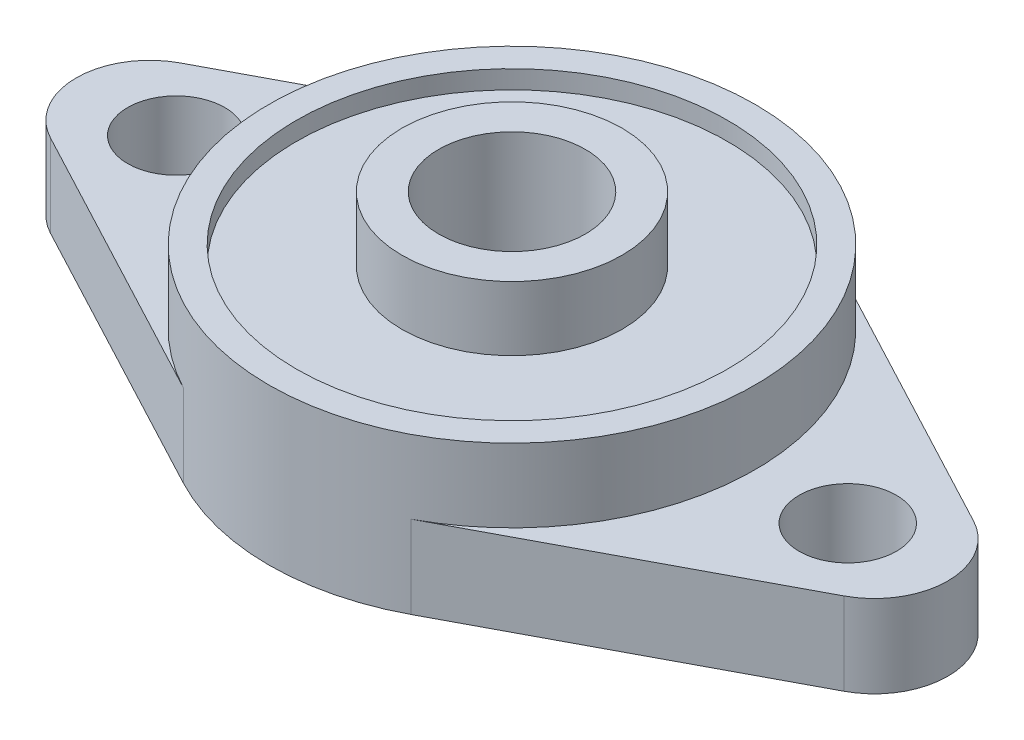
ISO-10303-21;
HEADER;
FILE_DESCRIPTION(('STEP AP214'),'2;1');
FILE_NAME('part.step','',(''),(''),'','','');
FILE_SCHEMA(('AUTOMOTIVE_DESIGN { 1 0 10303 214 1 1 1 1 }'));
ENDSEC;
DATA;
#1=APPLICATION_CONTEXT('core data for automotive mechanical design processes');
#2=APPLICATION_PROTOCOL_DEFINITION('international standard','automotive_design',2000,#1);
#3=PRODUCT_CONTEXT('',#1,'mechanical');
#4=PRODUCT('Part','Part','',(#3));
#5=PRODUCT_RELATED_PRODUCT_CATEGORY('part','',(#4));
#6=PRODUCT_DEFINITION_FORMATION('','',#4);
#7=PRODUCT_DEFINITION_CONTEXT('part definition',#1,'design');
#8=PRODUCT_DEFINITION('design','',#6,#7);
#9=PRODUCT_DEFINITION_SHAPE('','',#8);
#10=(LENGTH_UNIT() NAMED_UNIT(*) SI_UNIT(.MILLI.,.METRE.));
#11=(NAMED_UNIT(*) PLANE_ANGLE_UNIT() SI_UNIT($,.RADIAN.));
#12=(NAMED_UNIT(*) SI_UNIT($,.STERADIAN.) SOLID_ANGLE_UNIT());
#13=UNCERTAINTY_MEASURE_WITH_UNIT(LENGTH_MEASURE(1.E-05),#10,'distance_accuracy_value','');
#14=(GEOMETRIC_REPRESENTATION_CONTEXT(3) GLOBAL_UNCERTAINTY_ASSIGNED_CONTEXT((#13)) GLOBAL_UNIT_ASSIGNED_CONTEXT((#10,
#11,#12)) REPRESENTATION_CONTEXT('',''));
#15=CARTESIAN_POINT('',(0.,0.,0.));
#16=DIRECTION('',(0.,0.,1.));
#17=DIRECTION('',(1.,0.,0.));
#18=AXIS2_PLACEMENT_3D('',#15,#16,#17);
#19=CARTESIAN_POINT('',(0.,8.5,0.));
#20=DIRECTION('',(0.,1.,0.));
#21=DIRECTION('',(0.,0.,1.));
#22=AXIS2_PLACEMENT_3D('',#19,#20,#21);
#23=PLANE('',#22);
#24=CARTESIAN_POINT('',(0.,8.5,0.));
#25=DIRECTION('',(0.,1.,0.));
#26=DIRECTION('',(0.,0.,1.));
#27=AXIS2_PLACEMENT_3D('',#24,#25,#26);
#28=CIRCLE('',#27,11.75);
#29=CARTESIAN_POINT('',(0.,8.5,11.75));
#30=VERTEX_POINT('',#29);
#31=EDGE_CURVE('E207',#30,#30,#28,.T.);
#32=ORIENTED_EDGE('',*,*,#31,.F.);
#33=EDGE_LOOP('',(#32));
#34=FACE_BOUND('',#33,.T.);
#35=CARTESIAN_POINT('',(0.,8.5,0.));
#36=DIRECTION('',(0.,1.,0.));
#37=DIRECTION('',(0.,0.,1.));
#38=AXIS2_PLACEMENT_3D('',#35,#36,#37);
#39=CIRCLE('',#38,13.25);
#40=CARTESIAN_POINT('',(0.,8.5,13.25));
#41=VERTEX_POINT('',#40);
#42=EDGE_CURVE('E196',#41,#41,#39,.T.);
#43=ORIENTED_EDGE('',*,*,#42,.T.);
#44=EDGE_LOOP('',(#43));
#45=FACE_BOUND('',#44,.T.);
#46=ADVANCED_FACE('F34',(#34,#45),#23,.T.);
#47=CARTESIAN_POINT('',(0.,4.5,0.));
#48=DIRECTION('',(0.,-1.,0.));
#49=DIRECTION('',(0.,0.,-1.));
#50=AXIS2_PLACEMENT_3D('',#47,#48,#49);
#51=PLANE('',#50);
#52=CARTESIAN_POINT('',(18.3,4.5,0.));
#53=DIRECTION('',(0.,1.,0.));
#54=DIRECTION('',(0.,0.,1.));
#55=AXIS2_PLACEMENT_3D('',#52,#53,#54);
#56=CIRCLE('',#55,2.65);
#57=CARTESIAN_POINT('',(18.3,4.5,2.65));
#58=VERTEX_POINT('',#57);
#59=EDGE_CURVE('E186',#58,#58,#56,.T.);
#60=ORIENTED_EDGE('',*,*,#59,.F.);
#61=EDGE_LOOP('',(#60));
#62=FACE_BOUND('',#61,.T.);
#63=CARTESIAN_POINT('',(0.,4.5,0.));
#64=DIRECTION('',(0.,1.,0.));
#65=DIRECTION('',(0.,0.,1.));
#66=AXIS2_PLACEMENT_3D('',#63,#64,#65);
#67=CIRCLE('',#66,13.25);
#68=CARTESIAN_POINT('',(6.20569620253165,4.5,11.706913967476));
#69=VERTEX_POINT('',#68);
#70=CARTESIAN_POINT('',(6.20569620253165,4.5,-11.706913967476));
#71=VERTEX_POINT('',#70);
#72=EDGE_CURVE('E45',#69,#71,#67,.T.);
#73=ORIENTED_EDGE('',*,*,#72,.F.);
#74=DIRECTION('',(0.88354067679064,0.,-0.468354430379747));
#75=VECTOR('',#74,1.);
#76=CARTESIAN_POINT('',(6.20569620253165,4.5,11.706913967476));
#77=LINE('',#76,#75);
#78=CARTESIAN_POINT('',(21.623417721519,4.5,3.53416270716256));
#79=VERTEX_POINT('',#78);
#80=EDGE_CURVE('E107',#69,#79,#77,.T.);
#81=ORIENTED_EDGE('',*,*,#80,.T.);
#82=CARTESIAN_POINT('',(19.75,4.5,0.));
#83=DIRECTION('',(0.,1.,0.));
#84=DIRECTION('',(0.,0.,-1.));
#85=AXIS2_PLACEMENT_3D('',#82,#83,#84);
#86=CIRCLE('',#85,4.);
#87=CARTESIAN_POINT('',(21.623417721519,4.5,-3.53416270716256));
#88=VERTEX_POINT('',#87);
#89=EDGE_CURVE('E111',#79,#88,#86,.T.);
#90=ORIENTED_EDGE('',*,*,#89,.T.);
#91=DIRECTION('',(-0.88354067679064,0.,-0.468354430379747));
#92=VECTOR('',#91,1.);
#93=CARTESIAN_POINT('',(6.20569620253165,4.5,-11.706913967476));
#94=LINE('',#93,#92);
#95=EDGE_CURVE('E53',#88,#71,#94,.T.);
#96=ORIENTED_EDGE('',*,*,#95,.T.);
#97=EDGE_LOOP('',(#73,#81,#90,#96));
#98=FACE_BOUND('',#97,.T.);
#99=ADVANCED_FACE('F109',(#62,#98),#51,.F.);
#100=CARTESIAN_POINT('',(-18.3,4.5,0.));
#101=DIRECTION('',(0.,1.,0.));
#102=DIRECTION('',(0.,0.,1.));
#103=AXIS2_PLACEMENT_3D('',#100,#101,#102);
#104=CIRCLE('',#103,2.65);
#105=CARTESIAN_POINT('',(-18.3,4.5,2.65));
#106=VERTEX_POINT('',#105);
#107=EDGE_CURVE('E135',#106,#106,#104,.T.);
#108=ORIENTED_EDGE('',*,*,#107,.F.);
#109=EDGE_LOOP('',(#108));
#110=FACE_BOUND('',#109,.T.);
#111=CARTESIAN_POINT('',(-6.20569620253165,4.5,-11.706913967476));
#112=VERTEX_POINT('',#111);
#113=CARTESIAN_POINT('',(-6.20569620253164,4.5,11.706913967476));
#114=VERTEX_POINT('',#113);
#115=EDGE_CURVE('E11',#112,#114,#67,.T.);
#116=ORIENTED_EDGE('',*,*,#115,.F.);
#117=DIRECTION('',(-0.88354067679064,0.,0.468354430379747));
#118=VECTOR('',#117,1.);
#119=CARTESIAN_POINT('',(-6.20569620253165,4.5,-11.706913967476));
#120=LINE('',#119,#118);
#121=CARTESIAN_POINT('',(-21.623417721519,4.5,-3.53416270716256));
#122=VERTEX_POINT('',#121);
#123=EDGE_CURVE('E146',#112,#122,#120,.T.);
#124=ORIENTED_EDGE('',*,*,#123,.T.);
#125=CARTESIAN_POINT('',(-19.75,4.5,0.));
#126=DIRECTION('',(0.,1.,0.));
#127=DIRECTION('',(0.,0.,1.));
#128=AXIS2_PLACEMENT_3D('',#125,#126,#127);
#129=CIRCLE('',#128,4.);
#130=CARTESIAN_POINT('',(-21.623417721519,4.5,3.53416270716256));
#131=VERTEX_POINT('',#130);
#132=EDGE_CURVE('E179',#122,#131,#129,.T.);
#133=ORIENTED_EDGE('',*,*,#132,.T.);
#134=DIRECTION('',(0.88354067679064,0.,0.468354430379747));
#135=VECTOR('',#134,1.);
#136=CARTESIAN_POINT('',(-6.20569620253165,4.5,11.706913967476));
#137=LINE('',#136,#135);
#138=EDGE_CURVE('E116',#131,#114,#137,.T.);
#139=ORIENTED_EDGE('',*,*,#138,.T.);
#140=EDGE_LOOP('',(#116,#124,#133,#139));
#141=FACE_BOUND('',#140,.T.);
#142=ADVANCED_FACE('F250',(#110,#141),#51,.F.);
#143=CARTESIAN_POINT('',(0.,0.,0.));
#144=DIRECTION('',(0.,-1.,0.));
#145=DIRECTION('',(0.,0.,-1.));
#146=AXIS2_PLACEMENT_3D('',#143,#144,#145);
#147=PLANE('',#146);
#148=CARTESIAN_POINT('',(18.3,0.,0.));
#149=DIRECTION('',(0.,1.,0.));
#150=DIRECTION('',(0.,0.,1.));
#151=AXIS2_PLACEMENT_3D('',#148,#149,#150);
#152=CIRCLE('',#151,2.65);
#153=CARTESIAN_POINT('',(18.3,0.,2.65));
#154=VERTEX_POINT('',#153);
#155=EDGE_CURVE('E189',#154,#154,#152,.T.);
#156=ORIENTED_EDGE('',*,*,#155,.T.);
#157=EDGE_LOOP('',(#156));
#158=FACE_BOUND('',#157,.T.);
#159=CARTESIAN_POINT('',(0.,0.,0.));
#160=DIRECTION('',(0.,1.,0.));
#161=DIRECTION('',(0.,0.,-1.));
#162=AXIS2_PLACEMENT_3D('',#159,#160,#161);
#163=CIRCLE('',#162,13.25);
#164=CARTESIAN_POINT('',(6.20569620253165,0.,-11.706913967476));
#165=VERTEX_POINT('',#164);
#166=CARTESIAN_POINT('',(-6.20569620253165,0.,-11.706913967476));
#167=VERTEX_POINT('',#166);
#168=EDGE_CURVE('E131',#165,#167,#163,.T.);
#169=ORIENTED_EDGE('',*,*,#168,.F.);
#170=DIRECTION('',(-0.88354067679064,0.,-0.468354430379747));
#171=VECTOR('',#170,1.);
#172=CARTESIAN_POINT('',(6.20569620253165,0.,-11.706913967476));
#173=LINE('',#172,#171);
#174=CARTESIAN_POINT('',(21.623417721519,0.,-3.53416270716256));
#175=VERTEX_POINT('',#174);
#176=EDGE_CURVE('E89',#175,#165,#173,.T.);
#177=ORIENTED_EDGE('',*,*,#176,.F.);
#178=CARTESIAN_POINT('',(19.75,0.,0.));
#179=DIRECTION('',(0.,1.,0.));
#180=DIRECTION('',(0.,0.,-1.));
#181=AXIS2_PLACEMENT_3D('',#178,#179,#180);
#182=CIRCLE('',#181,4.);
#183=CARTESIAN_POINT('',(21.623417721519,0.,3.53416270716256));
#184=VERTEX_POINT('',#183);
#185=EDGE_CURVE('E83',#184,#175,#182,.T.);
#186=ORIENTED_EDGE('',*,*,#185,.F.);
#187=DIRECTION('',(0.88354067679064,0.,-0.468354430379747));
#188=VECTOR('',#187,1.);
#189=CARTESIAN_POINT('',(6.20569620253165,0.,11.706913967476));
#190=LINE('',#189,#188);
#191=CARTESIAN_POINT('',(6.20569620253165,0.,11.706913967476));
#192=VERTEX_POINT('',#191);
#193=EDGE_CURVE('E121',#192,#184,#190,.T.);
#194=ORIENTED_EDGE('',*,*,#193,.F.);
#195=CARTESIAN_POINT('',(0.,0.,0.));
#196=DIRECTION('',(0.,1.,0.));
#197=DIRECTION('',(0.,0.,1.));
#198=AXIS2_PLACEMENT_3D('',#195,#196,#197);
#199=CIRCLE('',#198,13.25);
#200=CARTESIAN_POINT('',(-6.20569620253164,0.,11.706913967476));
#201=VERTEX_POINT('',#200);
#202=EDGE_CURVE('E141',#201,#192,#199,.T.);
#203=ORIENTED_EDGE('',*,*,#202,.F.);
#204=DIRECTION('',(0.88354067679064,0.,0.468354430379747));
#205=VECTOR('',#204,1.);
#206=CARTESIAN_POINT('',(-6.20569620253165,0.,11.706913967476));
#207=LINE('',#206,#205);
#208=CARTESIAN_POINT('',(-21.623417721519,0.,3.53416270716256));
#209=VERTEX_POINT('',#208);
#210=EDGE_CURVE('E139',#209,#201,#207,.T.);
#211=ORIENTED_EDGE('',*,*,#210,.F.);
#212=CARTESIAN_POINT('',(-19.75,0.,0.));
#213=DIRECTION('',(0.,1.,0.));
#214=DIRECTION('',(0.,0.,1.));
#215=AXIS2_PLACEMENT_3D('',#212,#213,#214);
#216=CIRCLE('',#215,4.);
#217=CARTESIAN_POINT('',(-21.623417721519,0.,-3.53416270716256));
#218=VERTEX_POINT('',#217);
#219=EDGE_CURVE('E137',#218,#209,#216,.T.);
#220=ORIENTED_EDGE('',*,*,#219,.F.);
#221=DIRECTION('',(-0.88354067679064,0.,0.468354430379747));
#222=VECTOR('',#221,1.);
#223=CARTESIAN_POINT('',(-6.20569620253165,0.,-11.706913967476));
#224=LINE('',#223,#222);
#225=EDGE_CURVE('E134',#167,#218,#224,.T.);
#226=ORIENTED_EDGE('',*,*,#225,.F.);
#227=EDGE_LOOP('',(#169,#177,#186,#194,#203,#211,#220,#226));
#228=FACE_BOUND('',#227,.T.);
#229=CARTESIAN_POINT('',(-18.3,0.,0.));
#230=DIRECTION('',(0.,1.,0.));
#231=DIRECTION('',(0.,0.,1.));
#232=AXIS2_PLACEMENT_3D('',#229,#230,#231);
#233=CIRCLE('',#232,2.65);
#234=CARTESIAN_POINT('',(-18.3,0.,2.65));
#235=VERTEX_POINT('',#234);
#236=EDGE_CURVE('E183',#235,#235,#233,.T.);
#237=ORIENTED_EDGE('',*,*,#236,.T.);
#238=EDGE_LOOP('',(#237));
#239=FACE_BOUND('',#238,.T.);
#240=CARTESIAN_POINT('',(0.,0.,0.));
#241=DIRECTION('',(0.,1.,0.));
#242=DIRECTION('',(0.,0.,1.));
#243=AXIS2_PLACEMENT_3D('',#240,#241,#242);
#244=CIRCLE('',#243,4.);
#245=CARTESIAN_POINT('',(0.,0.,4.));
#246=VERTEX_POINT('',#245);
#247=EDGE_CURVE('E192',#246,#246,#244,.T.);
#248=ORIENTED_EDGE('',*,*,#247,.T.);
#249=EDGE_LOOP('',(#248));
#250=FACE_BOUND('',#249,.T.);
#251=ADVANCED_FACE('F169',(#158,#228,#239,#250),#147,.T.);
#252=CARTESIAN_POINT('',(-6.20569620253165,4.5,-11.706913967476));
#253=DIRECTION('',(0.468354430379747,0.,0.88354067679064));
#254=DIRECTION('',(0.883540676790641,0.,-0.468354430379747));
#255=AXIS2_PLACEMENT_3D('',#252,#253,#254);
#256=PLANE('',#255);
#257=ORIENTED_EDGE('',*,*,#225,.T.);
#258=DIRECTION('',(0.,-1.,0.));
#259=VECTOR('',#258,1.);
#260=CARTESIAN_POINT('',(-21.623417721519,4.5,-3.53416270716256));
#261=LINE('',#260,#259);
#262=EDGE_CURVE('E155',#122,#218,#261,.T.);
#263=ORIENTED_EDGE('',*,*,#262,.F.);
#264=ORIENTED_EDGE('',*,*,#123,.F.);
#265=DIRECTION('',(0.,-1.,0.));
#266=VECTOR('',#265,1.);
#267=CARTESIAN_POINT('',(-6.20569620253165,4.5,-11.706913967476));
#268=LINE('',#267,#266);
#269=EDGE_CURVE('E38',#112,#167,#268,.T.);
#270=ORIENTED_EDGE('',*,*,#269,.T.);
#271=EDGE_LOOP('',(#257,#263,#264,#270));
#272=FACE_BOUND('',#271,.T.);
#273=ADVANCED_FACE('F36',(#272),#256,.F.);
#274=CARTESIAN_POINT('',(-19.75,4.5,0.));
#275=DIRECTION('',(0.,-1.,0.));
#276=DIRECTION('',(0.,0.,-1.));
#277=AXIS2_PLACEMENT_3D('',#274,#275,#276);
#278=CYLINDRICAL_SURFACE('',#277,4.);
#279=ORIENTED_EDGE('',*,*,#219,.T.);
#280=DIRECTION('',(0.,-1.,0.));
#281=VECTOR('',#280,1.);
#282=CARTESIAN_POINT('',(-21.623417721519,4.5,3.53416270716256));
#283=LINE('',#282,#281);
#284=EDGE_CURVE('E153',#131,#209,#283,.T.);
#285=ORIENTED_EDGE('',*,*,#284,.F.);
#286=ORIENTED_EDGE('',*,*,#132,.F.);
#287=ORIENTED_EDGE('',*,*,#262,.T.);
#288=EDGE_LOOP('',(#279,#285,#286,#287));
#289=FACE_BOUND('',#288,.T.);
#290=ADVANCED_FACE('F174',(#289),#278,.T.);
#291=CARTESIAN_POINT('',(-6.20569620253165,4.5,11.706913967476));
#292=DIRECTION('',(0.468354430379747,0.,-0.88354067679064));
#293=DIRECTION('',(-0.883540676790641,0.,-0.468354430379747));
#294=AXIS2_PLACEMENT_3D('',#291,#292,#293);
#295=PLANE('',#294);
#296=ORIENTED_EDGE('',*,*,#210,.T.);
#297=DIRECTION('',(0.,-1.,0.));
#298=VECTOR('',#297,1.);
#299=CARTESIAN_POINT('',(-6.20569620253164,4.5,11.706913967476));
#300=LINE('',#299,#298);
#301=EDGE_CURVE('E150',#114,#201,#300,.T.);
#302=ORIENTED_EDGE('',*,*,#301,.F.);
#303=ORIENTED_EDGE('',*,*,#138,.F.);
#304=ORIENTED_EDGE('',*,*,#284,.T.);
#305=EDGE_LOOP('',(#296,#302,#303,#304));
#306=FACE_BOUND('',#305,.T.);
#307=ADVANCED_FACE('F177',(#306),#295,.F.);
#308=CARTESIAN_POINT('',(0.,4.5,0.));
#309=DIRECTION('',(0.,-1.,0.));
#310=DIRECTION('',(0.,0.,-1.));
#311=AXIS2_PLACEMENT_3D('',#308,#309,#310);
#312=CYLINDRICAL_SURFACE('',#311,13.25);
#313=ORIENTED_EDGE('',*,*,#202,.T.);
#314=DIRECTION('',(0.,-1.,0.));
#315=VECTOR('',#314,1.);
#316=CARTESIAN_POINT('',(6.20569620253165,4.5,11.706913967476));
#317=LINE('',#316,#315);
#318=EDGE_CURVE('E122',#69,#192,#317,.T.);
#319=ORIENTED_EDGE('',*,*,#318,.F.);
#320=ORIENTED_EDGE('',*,*,#72,.T.);
#321=DIRECTION('',(0.,-1.,0.));
#322=VECTOR('',#321,1.);
#323=CARTESIAN_POINT('',(6.20569620253165,4.5,-11.706913967476));
#324=LINE('',#323,#322);
#325=EDGE_CURVE('E127',#71,#165,#324,.T.);
#326=ORIENTED_EDGE('',*,*,#325,.T.);
#327=ORIENTED_EDGE('',*,*,#168,.T.);
#328=ORIENTED_EDGE('',*,*,#269,.F.);
#329=ORIENTED_EDGE('',*,*,#115,.T.);
#330=ORIENTED_EDGE('',*,*,#301,.T.);
#331=EDGE_LOOP('',(#313,#319,#320,#326,#327,#328,#329,#330));
#332=FACE_BOUND('',#331,.T.);
#333=ORIENTED_EDGE('',*,*,#42,.F.);
#334=EDGE_LOOP('',(#333));
#335=FACE_BOUND('',#334,.T.);
#336=ADVANCED_FACE('F166',(#332,#335),#312,.T.);
#337=CARTESIAN_POINT('',(6.20569620253165,4.5,11.706913967476));
#338=DIRECTION('',(-0.468354430379747,0.,-0.88354067679064));
#339=DIRECTION('',(-0.883540676790641,0.,0.468354430379747));
#340=AXIS2_PLACEMENT_3D('',#337,#338,#339);
#341=PLANE('',#340);
#342=ORIENTED_EDGE('',*,*,#193,.T.);
#343=DIRECTION('',(0.,-1.,0.));
#344=VECTOR('',#343,1.);
#345=CARTESIAN_POINT('',(21.623417721519,4.5,3.53416270716256));
#346=LINE('',#345,#344);
#347=EDGE_CURVE('E118',#79,#184,#346,.T.);
#348=ORIENTED_EDGE('',*,*,#347,.F.);
#349=ORIENTED_EDGE('',*,*,#80,.F.);
#350=ORIENTED_EDGE('',*,*,#318,.T.);
#351=EDGE_LOOP('',(#342,#348,#349,#350));
#352=FACE_BOUND('',#351,.T.);
#353=ADVANCED_FACE('F119',(#352),#341,.F.);
#354=CARTESIAN_POINT('',(19.75,4.5,0.));
#355=DIRECTION('',(0.,-1.,0.));
#356=DIRECTION('',(0.,0.,-1.));
#357=AXIS2_PLACEMENT_3D('',#354,#355,#356);
#358=CYLINDRICAL_SURFACE('',#357,4.);
#359=ORIENTED_EDGE('',*,*,#185,.T.);
#360=DIRECTION('',(0.,-1.,0.));
#361=VECTOR('',#360,1.);
#362=CARTESIAN_POINT('',(21.623417721519,4.5,-3.53416270716256));
#363=LINE('',#362,#361);
#364=EDGE_CURVE('E123',#88,#175,#363,.T.);
#365=ORIENTED_EDGE('',*,*,#364,.F.);
#366=ORIENTED_EDGE('',*,*,#89,.F.);
#367=ORIENTED_EDGE('',*,*,#347,.T.);
#368=EDGE_LOOP('',(#359,#365,#366,#367));
#369=FACE_BOUND('',#368,.T.);
#370=ADVANCED_FACE('F125',(#369),#358,.T.);
#371=CARTESIAN_POINT('',(6.20569620253165,4.5,-11.706913967476));
#372=DIRECTION('',(-0.468354430379747,0.,0.88354067679064));
#373=DIRECTION('',(0.883540676790641,0.,0.468354430379747));
#374=AXIS2_PLACEMENT_3D('',#371,#372,#373);
#375=PLANE('',#374);
#376=ORIENTED_EDGE('',*,*,#176,.T.);
#377=ORIENTED_EDGE('',*,*,#325,.F.);
#378=ORIENTED_EDGE('',*,*,#95,.F.);
#379=ORIENTED_EDGE('',*,*,#364,.T.);
#380=EDGE_LOOP('',(#376,#377,#378,#379));
#381=FACE_BOUND('',#380,.T.);
#382=ADVANCED_FACE('F260',(#381),#375,.F.);
#383=CARTESIAN_POINT('',(-18.3,4.5,0.));
#384=DIRECTION('',(0.,-1.,0.));
#385=DIRECTION('',(0.,0.,-1.));
#386=AXIS2_PLACEMENT_3D('',#383,#384,#385);
#387=CYLINDRICAL_SURFACE('',#386,2.65);
#388=ORIENTED_EDGE('',*,*,#107,.T.);
#389=EDGE_LOOP('',(#388));
#390=FACE_BOUND('',#389,.T.);
#391=ORIENTED_EDGE('',*,*,#236,.F.);
#392=EDGE_LOOP('',(#391));
#393=FACE_BOUND('',#392,.T.);
#394=ADVANCED_FACE('F262',(#390,#393),#387,.F.);
#395=CARTESIAN_POINT('',(18.3,4.5,0.));
#396=DIRECTION('',(0.,-1.,0.));
#397=DIRECTION('',(0.,0.,-1.));
#398=AXIS2_PLACEMENT_3D('',#395,#396,#397);
#399=CYLINDRICAL_SURFACE('',#398,2.65);
#400=ORIENTED_EDGE('',*,*,#59,.T.);
#401=EDGE_LOOP('',(#400));
#402=FACE_BOUND('',#401,.T.);
#403=ORIENTED_EDGE('',*,*,#155,.F.);
#404=EDGE_LOOP('',(#403));
#405=FACE_BOUND('',#404,.T.);
#406=ADVANCED_FACE('F279',(#402,#405),#399,.F.);
#407=CARTESIAN_POINT('',(0.,4.5,0.));
#408=DIRECTION('',(0.,-1.,0.));
#409=DIRECTION('',(0.,0.,-1.));
#410=AXIS2_PLACEMENT_3D('',#407,#408,#409);
#411=CYLINDRICAL_SURFACE('',#410,4.);
#412=ORIENTED_EDGE('',*,*,#247,.F.);
#413=EDGE_LOOP('',(#412));
#414=FACE_BOUND('',#413,.T.);
#415=CARTESIAN_POINT('',(0.,11.,0.));
#416=DIRECTION('',(0.,1.,0.));
#417=DIRECTION('',(0.,0.,1.));
#418=AXIS2_PLACEMENT_3D('',#415,#416,#417);
#419=CIRCLE('',#418,4.);
#420=CARTESIAN_POINT('',(0.,11.,4.));
#421=VERTEX_POINT('',#420);
#422=EDGE_CURVE('E203',#421,#421,#419,.T.);
#423=ORIENTED_EDGE('',*,*,#422,.T.);
#424=EDGE_LOOP('',(#423));
#425=FACE_BOUND('',#424,.T.);
#426=ADVANCED_FACE('F286',(#414,#425),#411,.F.);
#427=CARTESIAN_POINT('',(0.,11.,0.));
#428=DIRECTION('',(0.,1.,0.));
#429=DIRECTION('',(0.,0.,1.));
#430=AXIS2_PLACEMENT_3D('',#427,#428,#429);
#431=PLANE('',#430);
#432=CARTESIAN_POINT('',(0.,11.,0.));
#433=DIRECTION('',(0.,1.,0.));
#434=DIRECTION('',(0.,0.,1.));
#435=AXIS2_PLACEMENT_3D('',#432,#433,#434);
#436=CIRCLE('',#435,6.);
#437=CARTESIAN_POINT('',(0.,11.,6.));
#438=VERTEX_POINT('',#437);
#439=EDGE_CURVE('E198',#438,#438,#436,.T.);
#440=ORIENTED_EDGE('',*,*,#439,.T.);
#441=EDGE_LOOP('',(#440));
#442=FACE_BOUND('',#441,.T.);
#443=ORIENTED_EDGE('',*,*,#422,.F.);
#444=EDGE_LOOP('',(#443));
#445=FACE_BOUND('',#444,.T.);
#446=ADVANCED_FACE('F294',(#442,#445),#431,.T.);
#447=CARTESIAN_POINT('',(0.,11.,0.));
#448=DIRECTION('',(0.,-1.,0.));
#449=DIRECTION('',(0.,0.,-1.));
#450=AXIS2_PLACEMENT_3D('',#447,#448,#449);
#451=CYLINDRICAL_SURFACE('',#450,6.);
#452=ORIENTED_EDGE('',*,*,#439,.F.);
#453=EDGE_LOOP('',(#452));
#454=FACE_BOUND('',#453,.T.);
#455=CARTESIAN_POINT('',(0.,7.5,0.));
#456=DIRECTION('',(0.,1.,0.));
#457=DIRECTION('',(0.,0.,1.));
#458=AXIS2_PLACEMENT_3D('',#455,#456,#457);
#459=CIRCLE('',#458,6.);
#460=CARTESIAN_POINT('',(0.,7.5,6.));
#461=VERTEX_POINT('',#460);
#462=EDGE_CURVE('E210',#461,#461,#459,.T.);
#463=ORIENTED_EDGE('',*,*,#462,.T.);
#464=EDGE_LOOP('',(#463));
#465=FACE_BOUND('',#464,.T.);
#466=ADVANCED_FACE('F216',(#454,#465),#451,.T.);
#467=CARTESIAN_POINT('',(0.,7.5,0.));
#468=DIRECTION('',(0.,1.,0.));
#469=DIRECTION('',(0.,0.,1.));
#470=AXIS2_PLACEMENT_3D('',#467,#468,#469);
#471=CYLINDRICAL_SURFACE('',#470,11.75);
#472=CARTESIAN_POINT('',(0.,7.5,0.));
#473=DIRECTION('',(0.,1.,0.));
#474=DIRECTION('',(0.,0.,1.));
#475=AXIS2_PLACEMENT_3D('',#472,#473,#474);
#476=CIRCLE('',#475,11.75);
#477=CARTESIAN_POINT('',(0.,7.5,11.75));
#478=VERTEX_POINT('',#477);
#479=EDGE_CURVE('E206',#478,#478,#476,.T.);
#480=ORIENTED_EDGE('',*,*,#479,.F.);
#481=EDGE_LOOP('',(#480));
#482=FACE_BOUND('',#481,.T.);
#483=ORIENTED_EDGE('',*,*,#31,.T.);
#484=EDGE_LOOP('',(#483));
#485=FACE_BOUND('',#484,.T.);
#486=ADVANCED_FACE('F221',(#482,#485),#471,.F.);
#487=CARTESIAN_POINT('',(0.,7.5,0.));
#488=DIRECTION('',(0.,1.,0.));
#489=DIRECTION('',(0.,0.,1.));
#490=AXIS2_PLACEMENT_3D('',#487,#488,#489);
#491=PLANE('',#490);
#492=ORIENTED_EDGE('',*,*,#462,.F.);
#493=EDGE_LOOP('',(#492));
#494=FACE_BOUND('',#493,.T.);
#495=ORIENTED_EDGE('',*,*,#479,.T.);
#496=EDGE_LOOP('',(#495));
#497=FACE_BOUND('',#496,.T.);
#498=ADVANCED_FACE('F218',(#494,#497),#491,.T.);
#499=CLOSED_SHELL('',(#46,#99,#142,#251,#273,#290,#307,#336,#353,#370,#382,#394,#406,#426,#446,
#466,#486,#498));
#500=MANIFOLD_SOLID_BREP('B2',#499);
#501=ADVANCED_BREP_SHAPE_REPRESENTATION('',(#18,#500),#14);
#502=SHAPE_DEFINITION_REPRESENTATION(#9,#501);
ENDSEC;
END-ISO-10303-21;
